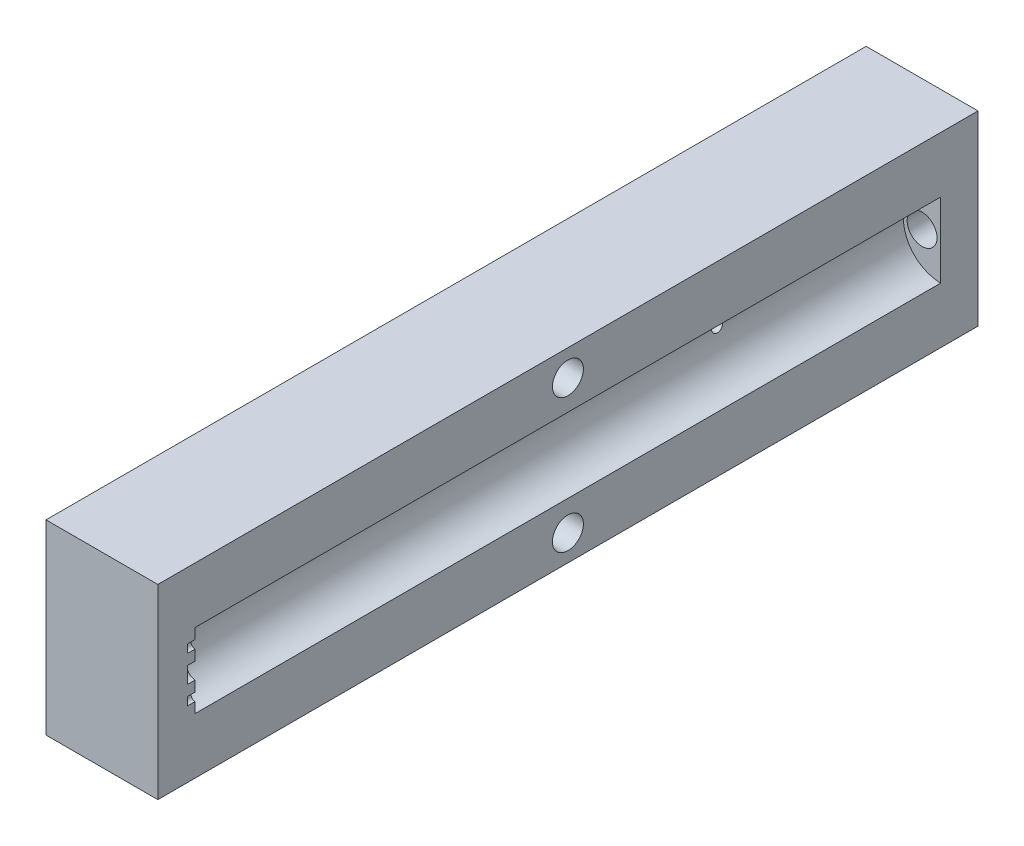
ISO-10303-21;
HEADER;
FILE_DESCRIPTION(('STEP AP214'),'2;1');
FILE_NAME('part.step','',(''),(''),'','','');
FILE_SCHEMA(('AUTOMOTIVE_DESIGN { 1 0 10303 214 1 1 1 1 }'));
ENDSEC;
DATA;
#1=APPLICATION_CONTEXT('core data for automotive mechanical design processes');
#2=APPLICATION_PROTOCOL_DEFINITION('international standard','automotive_design',2000,#1);
#3=PRODUCT_CONTEXT('',#1,'mechanical');
#4=PRODUCT('Part','Part','',(#3));
#5=PRODUCT_RELATED_PRODUCT_CATEGORY('part','',(#4));
#6=PRODUCT_DEFINITION_FORMATION('','',#4);
#7=PRODUCT_DEFINITION_CONTEXT('part definition',#1,'design');
#8=PRODUCT_DEFINITION('design','',#6,#7);
#9=PRODUCT_DEFINITION_SHAPE('','',#8);
#10=(LENGTH_UNIT() NAMED_UNIT(*) SI_UNIT(.MILLI.,.METRE.));
#11=(NAMED_UNIT(*) PLANE_ANGLE_UNIT() SI_UNIT($,.RADIAN.));
#12=(NAMED_UNIT(*) SI_UNIT($,.STERADIAN.) SOLID_ANGLE_UNIT());
#13=UNCERTAINTY_MEASURE_WITH_UNIT(LENGTH_MEASURE(1.E-05),#10,'distance_accuracy_value','');
#14=(GEOMETRIC_REPRESENTATION_CONTEXT(3) GLOBAL_UNCERTAINTY_ASSIGNED_CONTEXT((#13)) GLOBAL_UNIT_ASSIGNED_CONTEXT((#10,
#11,#12)) REPRESENTATION_CONTEXT('',''));
#15=CARTESIAN_POINT('',(0.,0.,0.));
#16=DIRECTION('',(0.,0.,1.));
#17=DIRECTION('',(1.,0.,0.));
#18=AXIS2_PLACEMENT_3D('',#15,#16,#17);
#19=CARTESIAN_POINT('',(-45.,-12.5,105.));
#20=DIRECTION('',(0.,0.,-1.));
#21=DIRECTION('',(1.,0.,0.));
#22=AXIS2_PLACEMENT_3D('',#19,#20,#21);
#23=PLANE('',#22);
#24=DIRECTION('',(0.,1.,0.));
#25=VECTOR('',#24,1.);
#26=CARTESIAN_POINT('',(-30.,-12.5,105.));
#27=LINE('',#26,#25);
#28=CARTESIAN_POINT('',(-30.,-12.5,105.));
#29=VERTEX_POINT('',#28);
#30=CARTESIAN_POINT('',(-30.,12.5,105.));
#31=VERTEX_POINT('',#30);
#32=EDGE_CURVE('E264',#29,#31,#27,.T.);
#33=ORIENTED_EDGE('',*,*,#32,.T.);
#34=DIRECTION('',(1.,0.,0.));
#35=VECTOR('',#34,1.);
#36=CARTESIAN_POINT('',(-45.,12.5,105.));
#37=LINE('',#36,#35);
#38=CARTESIAN_POINT('',(-45.,12.5,105.));
#39=VERTEX_POINT('',#38);
#40=EDGE_CURVE('E139',#39,#31,#37,.T.);
#41=ORIENTED_EDGE('',*,*,#40,.F.);
#42=DIRECTION('',(0.,1.,0.));
#43=VECTOR('',#42,1.);
#44=CARTESIAN_POINT('',(-45.,-12.5,105.));
#45=LINE('',#44,#43);
#46=CARTESIAN_POINT('',(-45.,-12.5,105.));
#47=VERTEX_POINT('',#46);
#48=EDGE_CURVE('E283',#47,#39,#45,.T.);
#49=ORIENTED_EDGE('',*,*,#48,.F.);
#50=DIRECTION('',(1.,0.,0.));
#51=VECTOR('',#50,1.);
#52=CARTESIAN_POINT('',(-45.,-12.5,105.));
#53=LINE('',#52,#51);
#54=EDGE_CURVE('E60',#47,#29,#53,.T.);
#55=ORIENTED_EDGE('',*,*,#54,.T.);
#56=EDGE_LOOP('',(#33,#41,#49,#55));
#57=FACE_BOUND('',#56,.T.);
#58=ADVANCED_FACE('F36',(#57),#23,.F.);
#59=CARTESIAN_POINT('',(-45.,12.5,105.));
#60=DIRECTION('',(0.,-1.,0.));
#61=DIRECTION('',(-1.,0.,0.));
#62=AXIS2_PLACEMENT_3D('',#59,#60,#61);
#63=PLANE('',#62);
#64=DIRECTION('',(0.,0.,-1.));
#65=VECTOR('',#64,1.);
#66=CARTESIAN_POINT('',(-30.,12.5,105.));
#67=LINE('',#66,#65);
#68=CARTESIAN_POINT('',(-30.,12.5,-5.));
#69=VERTEX_POINT('',#68);
#70=EDGE_CURVE('E266',#31,#69,#67,.T.);
#71=ORIENTED_EDGE('',*,*,#70,.T.);
#72=DIRECTION('',(1.,0.,0.));
#73=VECTOR('',#72,1.);
#74=CARTESIAN_POINT('',(-45.,12.5,-5.));
#75=LINE('',#74,#73);
#76=CARTESIAN_POINT('',(-45.,12.5,-5.));
#77=VERTEX_POINT('',#76);
#78=EDGE_CURVE('E287',#77,#69,#75,.T.);
#79=ORIENTED_EDGE('',*,*,#78,.F.);
#80=DIRECTION('',(0.,0.,-1.));
#81=VECTOR('',#80,1.);
#82=CARTESIAN_POINT('',(-45.,12.5,105.));
#83=LINE('',#82,#81);
#84=EDGE_CURVE('E87',#39,#77,#83,.T.);
#85=ORIENTED_EDGE('',*,*,#84,.F.);
#86=ORIENTED_EDGE('',*,*,#40,.T.);
#87=EDGE_LOOP('',(#71,#79,#85,#86));
#88=FACE_BOUND('',#87,.T.);
#89=ADVANCED_FACE('F258',(#88),#63,.F.);
#90=CARTESIAN_POINT('',(-45.,-12.5,-5.));
#91=DIRECTION('',(0.,0.,-1.));
#92=DIRECTION('',(1.,0.,0.));
#93=AXIS2_PLACEMENT_3D('',#90,#91,#92);
#94=PLANE('',#93);
#95=CARTESIAN_POINT('',(-32.5,0.,-5.00000000000001));
#96=DIRECTION('',(0.,0.,-1.));
#97=DIRECTION('',(-1.,0.,0.));
#98=AXIS2_PLACEMENT_3D('',#95,#96,#97);
#99=CIRCLE('',#98,2.025);
#100=CARTESIAN_POINT('',(-34.525,0.,-5.00000000000001));
#101=VERTEX_POINT('',#100);
#102=EDGE_CURVE('E189',#101,#101,#99,.T.);
#103=ORIENTED_EDGE('',*,*,#102,.F.);
#104=EDGE_LOOP('',(#103));
#105=FACE_BOUND('',#104,.T.);
#106=DIRECTION('',(0.,1.,0.));
#107=VECTOR('',#106,1.);
#108=CARTESIAN_POINT('',(-30.,-12.5,-5.));
#109=LINE('',#108,#107);
#110=CARTESIAN_POINT('',(-30.,-12.5,-5.));
#111=VERTEX_POINT('',#110);
#112=EDGE_CURVE('E270',#111,#69,#109,.T.);
#113=ORIENTED_EDGE('',*,*,#112,.F.);
#114=DIRECTION('',(1.,0.,0.));
#115=VECTOR('',#114,1.);
#116=CARTESIAN_POINT('',(-45.,-12.5,-5.));
#117=LINE('',#116,#115);
#118=CARTESIAN_POINT('',(-45.,-12.5,-5.));
#119=VERTEX_POINT('',#118);
#120=EDGE_CURVE('E285',#119,#111,#117,.T.);
#121=ORIENTED_EDGE('',*,*,#120,.F.);
#122=DIRECTION('',(0.,1.,0.));
#123=VECTOR('',#122,1.);
#124=CARTESIAN_POINT('',(-45.,-12.5,-5.));
#125=LINE('',#124,#123);
#126=EDGE_CURVE('E292',#119,#77,#125,.T.);
#127=ORIENTED_EDGE('',*,*,#126,.T.);
#128=ORIENTED_EDGE('',*,*,#78,.T.);
#129=EDGE_LOOP('',(#113,#121,#127,#128));
#130=FACE_BOUND('',#129,.T.);
#131=ADVANCED_FACE('F262',(#105,#130),#94,.T.);
#132=CARTESIAN_POINT('',(-45.,-12.5,105.));
#133=DIRECTION('',(0.,-1.,0.));
#134=DIRECTION('',(-1.,0.,0.));
#135=AXIS2_PLACEMENT_3D('',#132,#133,#134);
#136=PLANE('',#135);
#137=DIRECTION('',(0.,0.,-1.));
#138=VECTOR('',#137,1.);
#139=CARTESIAN_POINT('',(-30.,-12.5,105.));
#140=LINE('',#139,#138);
#141=EDGE_CURVE('E281',#29,#111,#140,.T.);
#142=ORIENTED_EDGE('',*,*,#141,.F.);
#143=ORIENTED_EDGE('',*,*,#54,.F.);
#144=DIRECTION('',(0.,0.,-1.));
#145=VECTOR('',#144,1.);
#146=CARTESIAN_POINT('',(-45.,-12.5,105.));
#147=LINE('',#146,#145);
#148=EDGE_CURVE('E276',#47,#119,#147,.T.);
#149=ORIENTED_EDGE('',*,*,#148,.T.);
#150=ORIENTED_EDGE('',*,*,#120,.T.);
#151=EDGE_LOOP('',(#142,#143,#149,#150));
#152=FACE_BOUND('',#151,.T.);
#153=ADVANCED_FACE('F372',(#152),#136,.T.);
#154=CARTESIAN_POINT('',(-45.,0.,0.));
#155=DIRECTION('',(-1.,0.,0.));
#156=DIRECTION('',(0.,0.,-1.));
#157=AXIS2_PLACEMENT_3D('',#154,#155,#156);
#158=PLANE('',#157);
#159=CARTESIAN_POINT('',(-45.,9.,50.));
#160=DIRECTION('',(-1.,0.,0.));
#161=DIRECTION('',(0.,0.,1.));
#162=AXIS2_PLACEMENT_3D('',#159,#160,#161);
#163=CIRCLE('',#162,2.07499999999999);
#164=CARTESIAN_POINT('',(-45.,9.,52.075));
#165=VERTEX_POINT('',#164);
#166=EDGE_CURVE('E340',#165,#165,#163,.T.);
#167=ORIENTED_EDGE('',*,*,#166,.F.);
#168=EDGE_LOOP('',(#167));
#169=FACE_BOUND('',#168,.T.);
#170=CARTESIAN_POINT('',(-45.,-9.,50.));
#171=DIRECTION('',(-1.,0.,0.));
#172=DIRECTION('',(0.,0.,1.));
#173=AXIS2_PLACEMENT_3D('',#170,#171,#172);
#174=CIRCLE('',#173,2.07499999999999);
#175=CARTESIAN_POINT('',(-45.,-9.,52.075));
#176=VERTEX_POINT('',#175);
#177=EDGE_CURVE('E337',#176,#176,#174,.T.);
#178=ORIENTED_EDGE('',*,*,#177,.F.);
#179=EDGE_LOOP('',(#178));
#180=FACE_BOUND('',#179,.T.);
#181=CARTESIAN_POINT('',(-45.,0.,25.));
#182=DIRECTION('',(-1.,0.,0.));
#183=DIRECTION('',(0.,0.,1.));
#184=AXIS2_PLACEMENT_3D('',#181,#182,#183);
#185=CIRCLE('',#184,0.775);
#186=CARTESIAN_POINT('',(-45.,0.,25.775));
#187=VERTEX_POINT('',#186);
#188=EDGE_CURVE('E331',#187,#187,#185,.T.);
#189=ORIENTED_EDGE('',*,*,#188,.F.);
#190=EDGE_LOOP('',(#189));
#191=FACE_BOUND('',#190,.T.);
#192=ORIENTED_EDGE('',*,*,#48,.T.);
#193=ORIENTED_EDGE('',*,*,#84,.T.);
#194=ORIENTED_EDGE('',*,*,#126,.F.);
#195=ORIENTED_EDGE('',*,*,#148,.F.);
#196=EDGE_LOOP('',(#192,#193,#194,#195));
#197=FACE_BOUND('',#196,.T.);
#198=ADVANCED_FACE('F365',(#169,#180,#191,#197),#158,.T.);
#199=CARTESIAN_POINT('',(-30.,0.,0.));
#200=DIRECTION('',(-1.,0.,0.));
#201=DIRECTION('',(0.,0.,-1.));
#202=AXIS2_PLACEMENT_3D('',#199,#200,#201);
#203=PLANE('',#202);
#204=CARTESIAN_POINT('',(-30.,9.,50.));
#205=DIRECTION('',(-1.,0.,0.));
#206=DIRECTION('',(0.,0.,-1.));
#207=AXIS2_PLACEMENT_3D('',#204,#205,#206);
#208=CIRCLE('',#207,2.07499999999999);
#209=CARTESIAN_POINT('',(-30.,9.,47.925));
#210=VERTEX_POINT('',#209);
#211=EDGE_CURVE('E39',#210,#210,#208,.T.);
#212=ORIENTED_EDGE('',*,*,#211,.T.);
#213=EDGE_LOOP('',(#212));
#214=FACE_BOUND('',#213,.T.);
#215=CARTESIAN_POINT('',(-30.,-9.,50.));
#216=DIRECTION('',(-1.,0.,0.));
#217=DIRECTION('',(0.,0.,-1.));
#218=AXIS2_PLACEMENT_3D('',#215,#216,#217);
#219=CIRCLE('',#218,2.07499999999999);
#220=CARTESIAN_POINT('',(-30.,-9.,47.925));
#221=VERTEX_POINT('',#220);
#222=EDGE_CURVE('E334',#221,#221,#219,.T.);
#223=ORIENTED_EDGE('',*,*,#222,.T.);
#224=EDGE_LOOP('',(#223));
#225=FACE_BOUND('',#224,.T.);
#226=DIRECTION('',(0.,0.,-1.));
#227=VECTOR('',#226,1.);
#228=CARTESIAN_POINT('',(-30.,2.50097322315044,101.));
#229=LINE('',#228,#227);
#230=CARTESIAN_POINT('',(-30.,2.50097322315044,101.));
#231=VERTEX_POINT('',#230);
#232=CARTESIAN_POINT('',(-30.,2.50097322315044,100.));
#233=VERTEX_POINT('',#232);
#234=EDGE_CURVE('E177',#231,#233,#229,.T.);
#235=ORIENTED_EDGE('',*,*,#234,.F.);
#236=DIRECTION('',(0.,1.,0.));
#237=VECTOR('',#236,1.);
#238=CARTESIAN_POINT('',(-30.,0.,101.));
#239=LINE('',#238,#237);
#240=CARTESIAN_POINT('',(-30.,3.60097322315044,101.));
#241=VERTEX_POINT('',#240);
#242=EDGE_CURVE('E11',#231,#241,#239,.T.);
#243=ORIENTED_EDGE('',*,*,#242,.T.);
#244=DIRECTION('',(0.,0.,-1.));
#245=VECTOR('',#244,1.);
#246=CARTESIAN_POINT('',(-30.,3.60097322315044,101.));
#247=LINE('',#246,#245);
#248=CARTESIAN_POINT('',(-30.,3.60097322315044,100.));
#249=VERTEX_POINT('',#248);
#250=EDGE_CURVE('E44',#249,#241,#247,.F.);
#251=ORIENTED_EDGE('',*,*,#250,.F.);
#252=DIRECTION('',(0.,1.,0.));
#253=VECTOR('',#252,1.);
#254=CARTESIAN_POINT('',(-30.,0.,100.));
#255=LINE('',#254,#253);
#256=CARTESIAN_POINT('',(-30.,5.,100.));
#257=VERTEX_POINT('',#256);
#258=EDGE_CURVE('E176',#249,#257,#255,.T.);
#259=ORIENTED_EDGE('',*,*,#258,.T.);
#260=DIRECTION('',(0.,0.,-1.));
#261=VECTOR('',#260,1.);
#262=CARTESIAN_POINT('',(-30.,5.,100.));
#263=LINE('',#262,#261);
#264=CARTESIAN_POINT('',(-30.,5.,0.));
#265=VERTEX_POINT('',#264);
#266=EDGE_CURVE('E169',#265,#257,#263,.F.);
#267=ORIENTED_EDGE('',*,*,#266,.F.);
#268=DIRECTION('',(0.,1.,0.));
#269=VECTOR('',#268,1.);
#270=CARTESIAN_POINT('',(-30.,0.,0.));
#271=LINE('',#270,#269);
#272=CARTESIAN_POINT('',(-30.,-5.,0.));
#273=VERTEX_POINT('',#272);
#274=EDGE_CURVE('E167',#273,#265,#271,.T.);
#275=ORIENTED_EDGE('',*,*,#274,.F.);
#276=DIRECTION('',(0.,0.,-1.));
#277=VECTOR('',#276,1.);
#278=CARTESIAN_POINT('',(-30.,-5.,100.));
#279=LINE('',#278,#277);
#280=CARTESIAN_POINT('',(-30.,-5.,100.));
#281=VERTEX_POINT('',#280);
#282=EDGE_CURVE('E163',#281,#273,#279,.T.);
#283=ORIENTED_EDGE('',*,*,#282,.F.);
#284=CARTESIAN_POINT('',(-30.,-3.60097322315044,100.));
#285=VERTEX_POINT('',#284);
#286=EDGE_CURVE('E154',#281,#285,#255,.T.);
#287=ORIENTED_EDGE('',*,*,#286,.T.);
#288=DIRECTION('',(0.,0.,-1.));
#289=VECTOR('',#288,1.);
#290=CARTESIAN_POINT('',(-30.,-3.60097322315044,101.));
#291=LINE('',#290,#289);
#292=CARTESIAN_POINT('',(-30.,-3.60097322315044,101.));
#293=VERTEX_POINT('',#292);
#294=EDGE_CURVE('E138',#293,#285,#291,.T.);
#295=ORIENTED_EDGE('',*,*,#294,.F.);
#296=DIRECTION('',(0.,1.,0.));
#297=VECTOR('',#296,1.);
#298=CARTESIAN_POINT('',(-30.,0.,101.));
#299=LINE('',#298,#297);
#300=CARTESIAN_POINT('',(-30.,-2.50097322315044,101.));
#301=VERTEX_POINT('',#300);
#302=EDGE_CURVE('E133',#293,#301,#299,.T.);
#303=ORIENTED_EDGE('',*,*,#302,.T.);
#304=DIRECTION('',(0.,0.,-1.));
#305=VECTOR('',#304,1.);
#306=CARTESIAN_POINT('',(-30.,-2.50097322315044,101.));
#307=LINE('',#306,#305);
#308=CARTESIAN_POINT('',(-30.,-2.50097322315044,100.));
#309=VERTEX_POINT('',#308);
#310=EDGE_CURVE('E145',#309,#301,#307,.F.);
#311=ORIENTED_EDGE('',*,*,#310,.F.);
#312=CARTESIAN_POINT('',(-30.,-1.1,100.));
#313=VERTEX_POINT('',#312);
#314=EDGE_CURVE('E156',#309,#313,#255,.T.);
#315=ORIENTED_EDGE('',*,*,#314,.T.);
#316=DIRECTION('',(0.,0.,-1.));
#317=VECTOR('',#316,1.);
#318=CARTESIAN_POINT('',(-30.,-1.1,101.));
#319=LINE('',#318,#317);
#320=CARTESIAN_POINT('',(-30.,-1.1,101.));
#321=VERTEX_POINT('',#320);
#322=EDGE_CURVE('E165',#321,#313,#319,.T.);
#323=ORIENTED_EDGE('',*,*,#322,.F.);
#324=DIRECTION('',(0.,1.,0.));
#325=VECTOR('',#324,1.);
#326=CARTESIAN_POINT('',(-30.,0.,101.));
#327=LINE('',#326,#325);
#328=CARTESIAN_POINT('',(-30.,1.1,101.));
#329=VERTEX_POINT('',#328);
#330=EDGE_CURVE('E171',#321,#329,#327,.T.);
#331=ORIENTED_EDGE('',*,*,#330,.T.);
#332=DIRECTION('',(0.,0.,-1.));
#333=VECTOR('',#332,1.);
#334=CARTESIAN_POINT('',(-30.,1.1,101.));
#335=LINE('',#334,#333);
#336=CARTESIAN_POINT('',(-30.,1.1,100.));
#337=VERTEX_POINT('',#336);
#338=EDGE_CURVE('E174',#337,#329,#335,.F.);
#339=ORIENTED_EDGE('',*,*,#338,.F.);
#340=EDGE_CURVE('E162',#337,#233,#255,.T.);
#341=ORIENTED_EDGE('',*,*,#340,.T.);
#342=EDGE_LOOP('',(#235,#243,#251,#259,#267,#275,#283,#287,#295,#303,#311,#315,#323,#331,#339,#341));
#343=FACE_BOUND('',#342,.T.);
#344=ORIENTED_EDGE('',*,*,#32,.F.);
#345=ORIENTED_EDGE('',*,*,#141,.T.);
#346=ORIENTED_EDGE('',*,*,#112,.T.);
#347=ORIENTED_EDGE('',*,*,#70,.F.);
#348=EDGE_LOOP('',(#344,#345,#346,#347));
#349=FACE_BOUND('',#348,.T.);
#350=ADVANCED_FACE('F151',(#214,#225,#343,#349),#203,.F.);
#351=CARTESIAN_POINT('',(-30.,0.,100.));
#352=DIRECTION('',(0.,0.,-1.));
#353=DIRECTION('',(1.,0.,0.));
#354=AXIS2_PLACEMENT_3D('',#351,#352,#353);
#355=CYLINDRICAL_SURFACE('',#354,5.);
#356=CARTESIAN_POINT('',(-35.,0.,25.75));
#357=CARTESIAN_POINT('',(-34.9999993288565,-0.0418757722408208,25.7499982730924));
#358=CARTESIAN_POINT('',(-34.9994684126852,-0.0837758425410653,25.7464809995797));
#359=CARTESIAN_POINT('',(-34.9974015798659,-0.166404813997456,25.7325084000086));
#360=CARTESIAN_POINT('',(-34.9958646846924,-0.207132534487114,25.7220463185275));
#361=CARTESIAN_POINT('',(-34.9919586060976,-0.286209043110929,25.6945037475162));
#362=CARTESIAN_POINT('',(-34.9895900518546,-0.324559603913398,25.677428260247));
#363=CARTESIAN_POINT('',(-34.9842823795586,-0.397845214317626,25.6371558102916));
#364=CARTESIAN_POINT('',(-34.9813433407639,-0.432780737362593,25.6139596977913));
#365=CARTESIAN_POINT('',(-34.9751958549573,-0.498523359781063,25.5619113675301));
#366=CARTESIAN_POINT('',(-34.9719856694517,-0.52929991611275,25.5330207718959));
#367=CARTESIAN_POINT('',(-34.9656713056662,-0.585587453344742,25.4704861555531));
#368=CARTESIAN_POINT('',(-34.9625671334925,-0.611098131364677,25.4368418616107));
#369=CARTESIAN_POINT('',(-34.9567993872936,-0.656248647499713,25.3655496782387));
#370=CARTESIAN_POINT('',(-34.9541380598752,-0.675858935186023,25.3278828765093));
#371=CARTESIAN_POINT('',(-34.9495810565313,-0.708463160855278,25.2497435896773));
#372=CARTESIAN_POINT('',(-34.9476853388772,-0.721457459445812,25.209271257628));
#373=CARTESIAN_POINT('',(-34.9448912810934,-0.740365993994552,25.1269909790641));
#374=CARTESIAN_POINT('',(-34.9439855787062,-0.746332518202586,25.085195303296));
#375=CARTESIAN_POINT('',(-34.9432517448529,-0.75117812016966,25.0011869170064));
#376=CARTESIAN_POINT('',(-34.9434235515157,-0.750057604868979,24.9589742305687));
#377=CARTESIAN_POINT('',(-34.9448185917621,-0.740803666253935,24.8756994599029));
#378=CARTESIAN_POINT('',(-34.9460330938077,-0.73272847963875,24.8346307367576));
#379=CARTESIAN_POINT('',(-34.9493630406318,-0.709885587018669,24.7544378155642));
#380=CARTESIAN_POINT('',(-34.9514785108969,-0.695117691689059,24.7153136725596));
#381=CARTESIAN_POINT('',(-34.9563816777274,-0.659248017648681,24.6399433143586));
#382=CARTESIAN_POINT('',(-34.9591719838326,-0.638121571415988,24.6037090154538));
#383=CARTESIAN_POINT('',(-34.9651085378727,-0.590152065644773,24.535277702109));
#384=CARTESIAN_POINT('',(-34.9682548091625,-0.56330863091239,24.5030809528653));
#385=CARTESIAN_POINT('',(-34.9745873652811,-0.504347465391239,24.4433011696301));
#386=CARTESIAN_POINT('',(-34.9777737355641,-0.472179664821001,24.4157675048568));
#387=CARTESIAN_POINT('',(-34.9837982382423,-0.403653544947094,24.3664820327464));
#388=CARTESIAN_POINT('',(-34.9866363691126,-0.367295207294086,24.344730250728));
#389=CARTESIAN_POINT('',(-34.991647577927,-0.291377299106844,24.3076234567502));
#390=CARTESIAN_POINT('',(-34.9938202596271,-0.25181583891839,24.2922722540798));
#391=CARTESIAN_POINT('',(-34.9972524527853,-0.17063659124353,24.2684453051573));
#392=CARTESIAN_POINT('',(-34.9985120259773,-0.129018942976301,24.2599690940922));
#393=CARTESIAN_POINT('',(-34.9999679056694,-0.0453347838218236,24.2501983850916));
#394=CARTESIAN_POINT('',(-35.0001742604519,-0.00327636593523548,24.2488360143103));
#395=CARTESIAN_POINT('',(-34.9995278050761,0.0804683388311411,24.2531515026555));
#396=CARTESIAN_POINT('',(-34.9986750277068,0.122154637190938,24.258829143834));
#397=CARTESIAN_POINT('',(-34.9960123430767,0.203766193715704,24.2770070500888));
#398=CARTESIAN_POINT('',(-34.9942070760399,0.243698981539919,24.2894742480154));
#399=CARTESIAN_POINT('',(-34.9898411782918,0.320907479321499,24.3208424987309));
#400=CARTESIAN_POINT('',(-34.9872805121078,0.358183064397548,24.3397438536668));
#401=CARTESIAN_POINT('',(-34.9816634123434,0.429317489645959,24.3836031122819));
#402=CARTESIAN_POINT('',(-34.9786035081337,0.463149504945782,24.4086040700064));
#403=CARTESIAN_POINT('',(-34.9723393150608,0.526161836588852,24.4638929058144));
#404=CARTESIAN_POINT('',(-34.9691350178143,0.5553418823967,24.4941810911623));
#405=CARTESIAN_POINT('',(-34.9629113215225,0.608468924785977,24.5594867665882));
#406=CARTESIAN_POINT('',(-34.9598936800879,0.632370423737107,24.5945414625974));
#407=CARTESIAN_POINT('',(-34.9544160955245,0.673945646352921,24.6682080202559));
#408=CARTESIAN_POINT('',(-34.9519561373281,0.691619538282178,24.7068197857607));
#409=CARTESIAN_POINT('',(-34.9478851650432,0.720167336619715,24.7863687668116));
#410=CARTESIAN_POINT('',(-34.9462711650322,0.731065185708175,24.8272972304856));
#411=CARTESIAN_POINT('',(-34.944066911489,0.74582774750793,24.9104295077175));
#412=CARTESIAN_POINT('',(-34.9434765872589,0.74969294591533,24.9526332329973));
#413=CARTESIAN_POINT('',(-34.9433891630542,0.750268933347197,25.0366645316579));
#414=CARTESIAN_POINT('',(-34.9438811316675,0.747051260836561,25.0784916208785));
#415=CARTESIAN_POINT('',(-34.9458791030559,0.733706147721891,25.1610026316618));
#416=CARTESIAN_POINT('',(-34.9473851042056,0.723578718193133,25.2016865550567));
#417=CARTESIAN_POINT('',(-34.9512376305615,0.696726867593324,25.2807365411172));
#418=CARTESIAN_POINT('',(-34.9535835185804,0.680007446621568,25.3191043352167));
#419=CARTESIAN_POINT('',(-34.9588522727885,0.640453338211544,25.3925018169012));
#420=CARTESIAN_POINT('',(-34.9617751585136,0.617618443707509,25.4275313914018));
#421=CARTESIAN_POINT('',(-34.9679037168247,0.56622168829582,25.4936215289876));
#422=CARTESIAN_POINT('',(-34.9711118394098,0.537606845199027,25.5246406666235));
#423=CARTESIAN_POINT('',(-34.9774289441332,0.475574420541416,25.5814622773939));
#424=CARTESIAN_POINT('',(-34.9805379030538,0.442155724175469,25.6072635362881));
#425=CARTESIAN_POINT('',(-34.9863259289526,0.37124785377186,25.6530438383037));
#426=CARTESIAN_POINT('',(-34.9890025356441,0.33373728838238,25.6729900546074));
#427=CARTESIAN_POINT('',(-34.9936001440148,0.25587593512436,25.706269258379));
#428=CARTESIAN_POINT('',(-34.9955219278288,0.215528138548353,25.7196090950268));
#429=CARTESIAN_POINT('',(-34.9979546963075,0.145832863944665,25.736270671355));
#430=CARTESIAN_POINT('',(-34.9987177458978,0.116915566747639,25.7414113007694));
#431=CARTESIAN_POINT('',(-34.9997406297395,0.0586694858000624,25.7482765488563));
#432=CARTESIAN_POINT('',(-35.0000004702439,0.0293407071672085,25.7500012099763));
#433=CARTESIAN_POINT('',(-35.,0.,25.75));
#434=B_SPLINE_CURVE_WITH_KNOTS('',3,(#356,#357,#358,#359,#360,#361,#362,#363,#364,#365,#366,
#367,#368,#369,#370,#371,#372,#373,#374,#375,#376,#377,#378,#379,#380,#381,#382,#383,#384,#385,
#386,#387,#388,#389,#390,#391,#392,#393,#394,#395,#396,#397,#398,#399,#400,#401,#402,#403,#404,
#405,#406,#407,#408,#409,#410,#411,#412,#413,#414,#415,#416,#417,#418,#419,#420,#421,#422,#423,
#424,#425,#426,#427,#428,#429,#430,#431,#432,#433),.UNSPECIFIED.,.T.,.F.,(4,2,2,2,2,2,2,2,2,2,2,
2,2,2,2,2,2,2,2,2,2,2,2,2,2,2,2,2,2,2,2,2,2,2,2,2,2,2,4),(0.,0.125520102515831,
0.251162481464574,0.376710011791618,0.502240112098796,0.628647080684217,0.755061317862898,
0.882098511976874,1.00912878112753,1.13520782302961,1.26127962549491,1.38630588597873,
1.5113356834518,1.63685691738079,1.76238639154266,1.88917145627703,2.01595707619333,
2.14281804492436,2.269670435967,2.39531029272127,2.52094625995577,2.64597574482973,
2.77101110188136,2.89695594018453,3.02290810014314,3.14990683292336,3.27690213404415,
3.40344611728583,3.52998136068587,3.65524444130531,3.7805073211478,3.90567536992072,
4.03084765733438,4.15722414982859,4.28363001734365,4.41073161692365,4.53770116630719,
4.62564925989403,4.71359626061644),.UNSPECIFIED.);
#435=CARTESIAN_POINT('',(-35.,0.,25.75));
#436=VERTEX_POINT('',#435);
#437=EDGE_CURVE('E182',#436,#436,#434,.T.);
#438=ORIENTED_EDGE('',*,*,#437,.F.);
#439=EDGE_LOOP('',(#438));
#440=FACE_BOUND('',#439,.T.);
#441=ORIENTED_EDGE('',*,*,#266,.T.);
#442=CARTESIAN_POINT('',(-30.,0.,100.));
#443=DIRECTION('',(0.,0.,1.));
#444=DIRECTION('',(-1.,0.,0.));
#445=AXIS2_PLACEMENT_3D('',#442,#443,#444);
#446=CIRCLE('',#445,5.);
#447=EDGE_CURVE('E273',#257,#281,#446,.T.);
#448=ORIENTED_EDGE('',*,*,#447,.T.);
#449=ORIENTED_EDGE('',*,*,#282,.T.);
#450=CARTESIAN_POINT('',(-30.,0.,0.));
#451=DIRECTION('',(0.,0.,1.));
#452=DIRECTION('',(-1.,0.,0.));
#453=AXIS2_PLACEMENT_3D('',#450,#451,#452);
#454=CIRCLE('',#453,5.);
#455=EDGE_CURVE('E298',#265,#273,#454,.T.);
#456=ORIENTED_EDGE('',*,*,#455,.F.);
#457=EDGE_LOOP('',(#441,#448,#449,#456));
#458=FACE_BOUND('',#457,.T.);
#459=ADVANCED_FACE('F191',(#440,#458),#355,.F.);
#460=CARTESIAN_POINT('',(-30.,0.,100.));
#461=DIRECTION('',(0.,0.,1.));
#462=DIRECTION('',(-1.,0.,0.));
#463=AXIS2_PLACEMENT_3D('',#460,#461,#462);
#464=PLANE('',#463);
#465=CARTESIAN_POINT('',(-32.6422203175144,-1.52548661157525,100.));
#466=DIRECTION('',(0.,0.,1.));
#467=DIRECTION('',(-1.,0.,0.));
#468=AXIS2_PLACEMENT_3D('',#465,#466,#467);
#469=CIRCLE('',#468,0.55);
#470=CARTESIAN_POINT('',(-33.1922203175143,-1.52548661157525,100.));
#471=VERTEX_POINT('',#470);
#472=EDGE_CURVE('E306',#471,#471,#469,.T.);
#473=ORIENTED_EDGE('',*,*,#472,.T.);
#474=EDGE_LOOP('',(#473));
#475=FACE_BOUND('',#474,.T.);
#476=CARTESIAN_POINT('',(-32.6422203175144,1.52548661157519,100.));
#477=DIRECTION('',(0.,0.,1.));
#478=DIRECTION('',(-1.,0.,0.));
#479=AXIS2_PLACEMENT_3D('',#476,#477,#478);
#480=CIRCLE('',#479,0.55);
#481=CARTESIAN_POINT('',(-33.1922203175144,1.52548661157519,100.));
#482=VERTEX_POINT('',#481);
#483=EDGE_CURVE('E310',#482,#482,#480,.T.);
#484=ORIENTED_EDGE('',*,*,#483,.T.);
#485=EDGE_LOOP('',(#484));
#486=FACE_BOUND('',#485,.T.);
#487=ORIENTED_EDGE('',*,*,#447,.F.);
#488=ORIENTED_EDGE('',*,*,#258,.F.);
#489=CARTESIAN_POINT('',(-30.,3.05097322315044,100.));
#490=DIRECTION('',(0.,0.,1.));
#491=DIRECTION('',(-1.,0.,0.));
#492=AXIS2_PLACEMENT_3D('',#489,#490,#491);
#493=CIRCLE('',#492,0.55);
#494=EDGE_CURVE('E316',#249,#233,#493,.T.);
#495=ORIENTED_EDGE('',*,*,#494,.T.);
#496=ORIENTED_EDGE('',*,*,#340,.F.);
#497=CARTESIAN_POINT('',(-30.,0.,100.));
#498=DIRECTION('',(0.,0.,1.));
#499=DIRECTION('',(-1.,0.,0.));
#500=AXIS2_PLACEMENT_3D('',#497,#498,#499);
#501=CIRCLE('',#500,1.1);
#502=EDGE_CURVE('E267',#337,#313,#501,.T.);
#503=ORIENTED_EDGE('',*,*,#502,.T.);
#504=ORIENTED_EDGE('',*,*,#314,.F.);
#505=CARTESIAN_POINT('',(-30.,-3.05097322315044,100.));
#506=DIRECTION('',(0.,0.,1.));
#507=DIRECTION('',(-1.,0.,0.));
#508=AXIS2_PLACEMENT_3D('',#505,#506,#507);
#509=CIRCLE('',#508,0.55);
#510=EDGE_CURVE('E146',#309,#285,#509,.T.);
#511=ORIENTED_EDGE('',*,*,#510,.T.);
#512=ORIENTED_EDGE('',*,*,#286,.F.);
#513=EDGE_LOOP('',(#487,#488,#495,#496,#503,#504,#511,#512));
#514=FACE_BOUND('',#513,.T.);
#515=ADVANCED_FACE('F248',(#475,#486,#514),#464,.F.);
#516=CARTESIAN_POINT('',(-30.,0.,0.));
#517=DIRECTION('',(0.,0.,1.));
#518=DIRECTION('',(-1.,0.,0.));
#519=AXIS2_PLACEMENT_3D('',#516,#517,#518);
#520=PLANE('',#519);
#521=CARTESIAN_POINT('',(-32.5,0.,0.));
#522=DIRECTION('',(0.,0.,1.));
#523=DIRECTION('',(-1.,0.,0.));
#524=AXIS2_PLACEMENT_3D('',#521,#522,#523);
#525=CIRCLE('',#524,1.99999999999999);
#526=CARTESIAN_POINT('',(-34.5,0.,0.));
#527=VERTEX_POINT('',#526);
#528=EDGE_CURVE('E147',#527,#527,#525,.T.);
#529=ORIENTED_EDGE('',*,*,#528,.F.);
#530=EDGE_LOOP('',(#529));
#531=FACE_BOUND('',#530,.T.);
#532=ORIENTED_EDGE('',*,*,#274,.T.);
#533=ORIENTED_EDGE('',*,*,#455,.T.);
#534=EDGE_LOOP('',(#532,#533));
#535=FACE_BOUND('',#534,.T.);
#536=ADVANCED_FACE('F246',(#531,#535),#520,.T.);
#537=CARTESIAN_POINT('',(-30.,0.,101.));
#538=DIRECTION('',(0.,0.,-1.));
#539=DIRECTION('',(1.,0.,0.));
#540=AXIS2_PLACEMENT_3D('',#537,#538,#539);
#541=CYLINDRICAL_SURFACE('',#540,1.1);
#542=ORIENTED_EDGE('',*,*,#338,.T.);
#543=CARTESIAN_POINT('',(-30.,0.,101.));
#544=DIRECTION('',(0.,0.,1.));
#545=DIRECTION('',(-1.,0.,0.));
#546=AXIS2_PLACEMENT_3D('',#543,#544,#545);
#547=CIRCLE('',#546,1.1);
#548=EDGE_CURVE('E301',#329,#321,#547,.T.);
#549=ORIENTED_EDGE('',*,*,#548,.T.);
#550=ORIENTED_EDGE('',*,*,#322,.T.);
#551=ORIENTED_EDGE('',*,*,#502,.F.);
#552=EDGE_LOOP('',(#542,#549,#550,#551));
#553=FACE_BOUND('',#552,.T.);
#554=ADVANCED_FACE('F242',(#553),#541,.F.);
#555=CARTESIAN_POINT('',(-30.,0.,101.));
#556=DIRECTION('',(0.,0.,1.));
#557=DIRECTION('',(-1.,0.,0.));
#558=AXIS2_PLACEMENT_3D('',#555,#556,#557);
#559=PLANE('',#558);
#560=ORIENTED_EDGE('',*,*,#548,.F.);
#561=ORIENTED_EDGE('',*,*,#330,.F.);
#562=EDGE_LOOP('',(#560,#561));
#563=FACE_BOUND('',#562,.T.);
#564=ADVANCED_FACE('F221',(#563),#559,.F.);
#565=CARTESIAN_POINT('',(-30.,3.05097322315044,101.));
#566=DIRECTION('',(0.,0.,-1.));
#567=DIRECTION('',(1.,0.,0.));
#568=AXIS2_PLACEMENT_3D('',#565,#566,#567);
#569=CYLINDRICAL_SURFACE('',#568,0.55);
#570=ORIENTED_EDGE('',*,*,#250,.T.);
#571=CARTESIAN_POINT('',(-30.,3.05097322315044,101.));
#572=DIRECTION('',(0.,0.,1.));
#573=DIRECTION('',(-1.,0.,0.));
#574=AXIS2_PLACEMENT_3D('',#571,#572,#573);
#575=CIRCLE('',#574,0.55);
#576=EDGE_CURVE('E319',#241,#231,#575,.T.);
#577=ORIENTED_EDGE('',*,*,#576,.T.);
#578=ORIENTED_EDGE('',*,*,#234,.T.);
#579=ORIENTED_EDGE('',*,*,#494,.F.);
#580=EDGE_LOOP('',(#570,#577,#578,#579));
#581=FACE_BOUND('',#580,.T.);
#582=ADVANCED_FACE('F218',(#581),#569,.F.);
#583=CARTESIAN_POINT('',(-30.,3.05097322315044,101.));
#584=DIRECTION('',(0.,0.,1.));
#585=DIRECTION('',(-1.,0.,0.));
#586=AXIS2_PLACEMENT_3D('',#583,#584,#585);
#587=PLANE('',#586);
#588=ORIENTED_EDGE('',*,*,#576,.F.);
#589=ORIENTED_EDGE('',*,*,#242,.F.);
#590=EDGE_LOOP('',(#588,#589));
#591=FACE_BOUND('',#590,.T.);
#592=ADVANCED_FACE('F214',(#591),#587,.F.);
#593=CARTESIAN_POINT('',(-30.,-3.05097322315044,101.));
#594=DIRECTION('',(0.,0.,-1.));
#595=DIRECTION('',(1.,0.,0.));
#596=AXIS2_PLACEMENT_3D('',#593,#594,#595);
#597=CYLINDRICAL_SURFACE('',#596,0.55);
#598=ORIENTED_EDGE('',*,*,#310,.T.);
#599=CARTESIAN_POINT('',(-30.,-3.05097322315044,101.));
#600=DIRECTION('',(0.,0.,1.));
#601=DIRECTION('',(-1.,0.,0.));
#602=AXIS2_PLACEMENT_3D('',#599,#600,#601);
#603=CIRCLE('',#602,0.55);
#604=EDGE_CURVE('E51',#301,#293,#603,.T.);
#605=ORIENTED_EDGE('',*,*,#604,.T.);
#606=ORIENTED_EDGE('',*,*,#294,.T.);
#607=ORIENTED_EDGE('',*,*,#510,.F.);
#608=EDGE_LOOP('',(#598,#605,#606,#607));
#609=FACE_BOUND('',#608,.T.);
#610=ADVANCED_FACE('F142',(#609),#597,.F.);
#611=CARTESIAN_POINT('',(-30.,-3.05097322315044,101.));
#612=DIRECTION('',(0.,0.,1.));
#613=DIRECTION('',(-1.,0.,0.));
#614=AXIS2_PLACEMENT_3D('',#611,#612,#613);
#615=PLANE('',#614);
#616=ORIENTED_EDGE('',*,*,#604,.F.);
#617=ORIENTED_EDGE('',*,*,#302,.F.);
#618=EDGE_LOOP('',(#616,#617));
#619=FACE_BOUND('',#618,.T.);
#620=ADVANCED_FACE('F134',(#619),#615,.F.);
#621=CARTESIAN_POINT('',(-32.6422203175144,-1.52548661157525,101.));
#622=DIRECTION('',(0.,0.,-1.));
#623=DIRECTION('',(1.,0.,0.));
#624=AXIS2_PLACEMENT_3D('',#621,#622,#623);
#625=CYLINDRICAL_SURFACE('',#624,0.55);
#626=CARTESIAN_POINT('',(-32.6422203175144,-1.52548661157525,101.));
#627=DIRECTION('',(0.,0.,1.));
#628=DIRECTION('',(-1.,0.,0.));
#629=AXIS2_PLACEMENT_3D('',#626,#627,#628);
#630=CIRCLE('',#629,0.55);
#631=CARTESIAN_POINT('',(-33.1922203175143,-1.52548661157525,101.));
#632=VERTEX_POINT('',#631);
#633=EDGE_CURVE('E307',#632,#632,#630,.T.);
#634=ORIENTED_EDGE('',*,*,#633,.T.);
#635=EDGE_LOOP('',(#634));
#636=FACE_BOUND('',#635,.T.);
#637=ORIENTED_EDGE('',*,*,#472,.F.);
#638=EDGE_LOOP('',(#637));
#639=FACE_BOUND('',#638,.T.);
#640=ADVANCED_FACE('F217',(#636,#639),#625,.F.);
#641=CARTESIAN_POINT('',(-32.6422203175144,-1.52548661157525,101.));
#642=DIRECTION('',(0.,0.,1.));
#643=DIRECTION('',(-1.,0.,0.));
#644=AXIS2_PLACEMENT_3D('',#641,#642,#643);
#645=PLANE('',#644);
#646=ORIENTED_EDGE('',*,*,#633,.F.);
#647=EDGE_LOOP('',(#646));
#648=FACE_BOUND('',#647,.T.);
#649=ADVANCED_FACE('F229',(#648),#645,.F.);
#650=CARTESIAN_POINT('',(-32.6422203175144,1.52548661157519,101.));
#651=DIRECTION('',(0.,0.,-1.));
#652=DIRECTION('',(1.,0.,0.));
#653=AXIS2_PLACEMENT_3D('',#650,#651,#652);
#654=CYLINDRICAL_SURFACE('',#653,0.55);
#655=CARTESIAN_POINT('',(-32.6422203175144,1.52548661157519,101.));
#656=DIRECTION('',(0.,0.,1.));
#657=DIRECTION('',(-1.,0.,0.));
#658=AXIS2_PLACEMENT_3D('',#655,#656,#657);
#659=CIRCLE('',#658,0.55);
#660=CARTESIAN_POINT('',(-33.1922203175144,1.52548661157519,101.));
#661=VERTEX_POINT('',#660);
#662=EDGE_CURVE('E313',#661,#661,#659,.T.);
#663=ORIENTED_EDGE('',*,*,#662,.T.);
#664=EDGE_LOOP('',(#663));
#665=FACE_BOUND('',#664,.T.);
#666=ORIENTED_EDGE('',*,*,#483,.F.);
#667=EDGE_LOOP('',(#666));
#668=FACE_BOUND('',#667,.T.);
#669=ADVANCED_FACE('F226',(#665,#668),#654,.F.);
#670=CARTESIAN_POINT('',(-32.6422203175144,1.52548661157519,101.));
#671=DIRECTION('',(0.,0.,1.));
#672=DIRECTION('',(-1.,0.,0.));
#673=AXIS2_PLACEMENT_3D('',#670,#671,#672);
#674=PLANE('',#673);
#675=ORIENTED_EDGE('',*,*,#662,.F.);
#676=EDGE_LOOP('',(#675));
#677=FACE_BOUND('',#676,.T.);
#678=ADVANCED_FACE('F210',(#677),#674,.F.);
#679=CARTESIAN_POINT('',(-32.5,0.,-5.));
#680=DIRECTION('',(0.,0.,-1.));
#681=DIRECTION('',(-1.,0.,0.));
#682=AXIS2_PLACEMENT_3D('',#679,#680,#681);
#683=CYLINDRICAL_SURFACE('',#682,1.99999999999999);
#684=ORIENTED_EDGE('',*,*,#528,.T.);
#685=EDGE_LOOP('',(#684));
#686=FACE_BOUND('',#685,.T.);
#687=CARTESIAN_POINT('',(-32.5,0.,-4.975));
#688=DIRECTION('',(0.,0.,-1.));
#689=DIRECTION('',(-1.,0.,0.));
#690=AXIS2_PLACEMENT_3D('',#687,#688,#689);
#691=CIRCLE('',#690,2.);
#692=CARTESIAN_POINT('',(-34.5,0.,-4.975));
#693=VERTEX_POINT('',#692);
#694=EDGE_CURVE('E181',#693,#693,#691,.T.);
#695=ORIENTED_EDGE('',*,*,#694,.T.);
#696=EDGE_LOOP('',(#695));
#697=FACE_BOUND('',#696,.T.);
#698=ADVANCED_FACE('F206',(#686,#697),#683,.F.);
#699=CARTESIAN_POINT('',(-32.5,0.,-5.00000000000001));
#700=DIRECTION('',(0.,0.,-1.));
#701=DIRECTION('',(-1.,0.,0.));
#702=AXIS2_PLACEMENT_3D('',#699,#700,#701);
#703=CONICAL_SURFACE('',#702,2.025,0.785398163397388);
#704=ORIENTED_EDGE('',*,*,#694,.F.);
#705=EDGE_LOOP('',(#704));
#706=FACE_BOUND('',#705,.T.);
#707=ORIENTED_EDGE('',*,*,#102,.T.);
#708=EDGE_LOOP('',(#707));
#709=FACE_BOUND('',#708,.T.);
#710=ADVANCED_FACE('F201',(#706,#709),#703,.F.);
#711=CARTESIAN_POINT('',(-45.,0.,25.));
#712=DIRECTION('',(-1.,0.,0.));
#713=DIRECTION('',(0.,0.,1.));
#714=AXIS2_PLACEMENT_3D('',#711,#712,#713);
#715=CYLINDRICAL_SURFACE('',#714,0.749999999999998);
#716=ORIENTED_EDGE('',*,*,#437,.T.);
#717=EDGE_LOOP('',(#716));
#718=FACE_BOUND('',#717,.T.);
#719=CARTESIAN_POINT('',(-44.975,0.,25.));
#720=DIRECTION('',(-1.,0.,0.));
#721=DIRECTION('',(0.,0.,1.));
#722=AXIS2_PLACEMENT_3D('',#719,#720,#721);
#723=CIRCLE('',#722,0.749999999999998);
#724=CARTESIAN_POINT('',(-44.975,0.,25.75));
#725=VERTEX_POINT('',#724);
#726=EDGE_CURVE('E190',#725,#725,#723,.T.);
#727=ORIENTED_EDGE('',*,*,#726,.T.);
#728=EDGE_LOOP('',(#727));
#729=FACE_BOUND('',#728,.T.);
#730=ADVANCED_FACE('F195',(#718,#729),#715,.F.);
#731=CARTESIAN_POINT('',(-45.,0.,25.));
#732=DIRECTION('',(-1.,0.,0.));
#733=DIRECTION('',(0.,0.,1.));
#734=AXIS2_PLACEMENT_3D('',#731,#732,#733);
#735=CONICAL_SURFACE('',#734,0.775,0.785398163397438);
#736=ORIENTED_EDGE('',*,*,#726,.F.);
#737=EDGE_LOOP('',(#736));
#738=FACE_BOUND('',#737,.T.);
#739=ORIENTED_EDGE('',*,*,#188,.T.);
#740=EDGE_LOOP('',(#739));
#741=FACE_BOUND('',#740,.T.);
#742=ADVANCED_FACE('F200',(#738,#741),#735,.F.);
#743=CARTESIAN_POINT('',(-45.,-9.,50.));
#744=DIRECTION('',(-1.,0.,0.));
#745=DIRECTION('',(0.,0.,1.));
#746=AXIS2_PLACEMENT_3D('',#743,#744,#745);
#747=CYLINDRICAL_SURFACE('',#746,2.07499999999999);
#748=ORIENTED_EDGE('',*,*,#177,.T.);
#749=EDGE_LOOP('',(#748));
#750=FACE_BOUND('',#749,.T.);
#751=ORIENTED_EDGE('',*,*,#222,.F.);
#752=EDGE_LOOP('',(#751));
#753=FACE_BOUND('',#752,.T.);
#754=ADVANCED_FACE('F351',(#750,#753),#747,.F.);
#755=CARTESIAN_POINT('',(-45.,9.,50.));
#756=DIRECTION('',(-1.,0.,0.));
#757=DIRECTION('',(0.,0.,1.));
#758=AXIS2_PLACEMENT_3D('',#755,#756,#757);
#759=CYLINDRICAL_SURFACE('',#758,2.07499999999999);
#760=ORIENTED_EDGE('',*,*,#166,.T.);
#761=EDGE_LOOP('',(#760));
#762=FACE_BOUND('',#761,.T.);
#763=ORIENTED_EDGE('',*,*,#211,.F.);
#764=EDGE_LOOP('',(#763));
#765=FACE_BOUND('',#764,.T.);
#766=ADVANCED_FACE('F349',(#762,#765),#759,.F.);
#767=CLOSED_SHELL('',(#58,#89,#131,#153,#198,#350,#459,#515,#536,#554,#564,#582,#592,#610,#620,
#640,#649,#669,#678,#698,#710,#730,#742,#754,#766));
#768=MANIFOLD_SOLID_BREP('B2',#767);
#769=ADVANCED_BREP_SHAPE_REPRESENTATION('',(#18,#768),#14);
#770=SHAPE_DEFINITION_REPRESENTATION(#9,#769);
ENDSEC;
END-ISO-10303-21;
